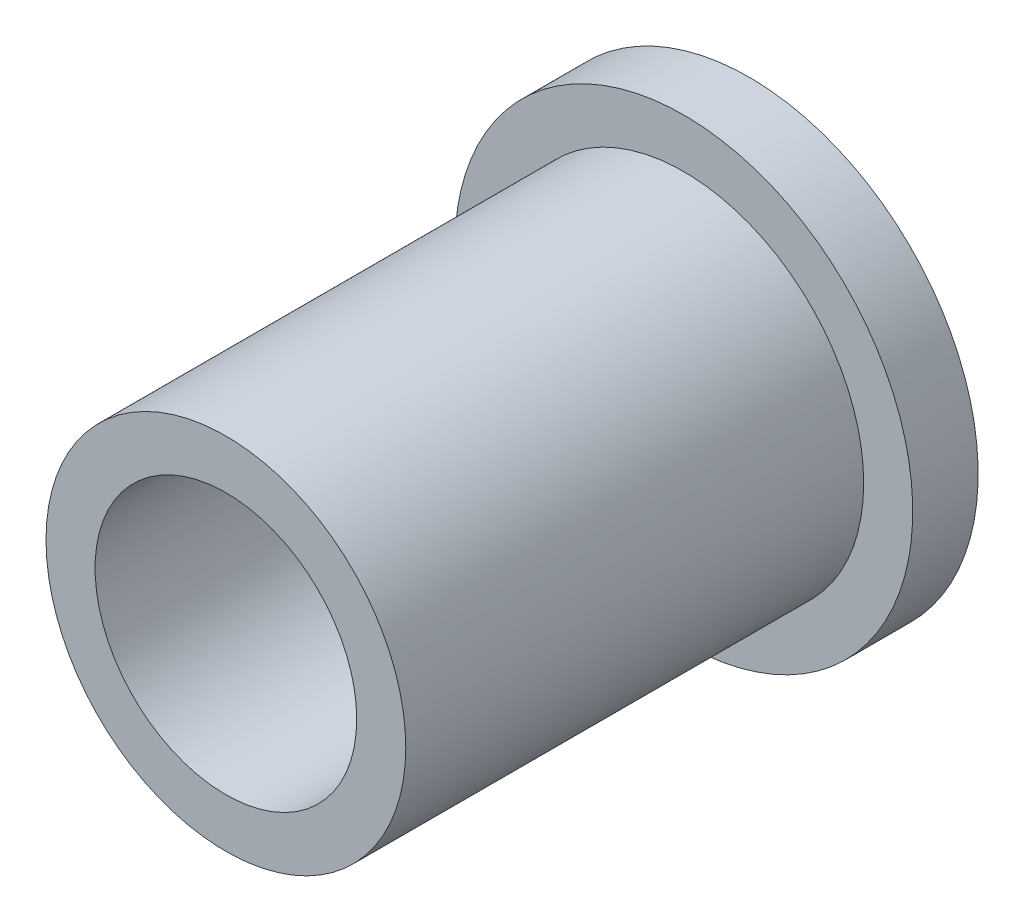
ISO-10303-21;
HEADER;
FILE_DESCRIPTION(('STEP AP214'),'2;1');
FILE_NAME('part.step','',(''),(''),'','','');
FILE_SCHEMA(('AUTOMOTIVE_DESIGN { 1 0 10303 214 1 1 1 1 }'));
ENDSEC;
DATA;
#1=APPLICATION_CONTEXT('core data for automotive mechanical design processes');
#2=APPLICATION_PROTOCOL_DEFINITION('international standard','automotive_design',2000,#1);
#3=PRODUCT_CONTEXT('',#1,'mechanical');
#4=PRODUCT('Part','Part','',(#3));
#5=PRODUCT_RELATED_PRODUCT_CATEGORY('part','',(#4));
#6=PRODUCT_DEFINITION_FORMATION('','',#4);
#7=PRODUCT_DEFINITION_CONTEXT('part definition',#1,'design');
#8=PRODUCT_DEFINITION('design','',#6,#7);
#9=PRODUCT_DEFINITION_SHAPE('','',#8);
#10=(LENGTH_UNIT() NAMED_UNIT(*) SI_UNIT(.MILLI.,.METRE.));
#11=(NAMED_UNIT(*) PLANE_ANGLE_UNIT() SI_UNIT($,.RADIAN.));
#12=(NAMED_UNIT(*) SI_UNIT($,.STERADIAN.) SOLID_ANGLE_UNIT());
#13=UNCERTAINTY_MEASURE_WITH_UNIT(LENGTH_MEASURE(1.E-05),#10,'distance_accuracy_value','');
#14=(GEOMETRIC_REPRESENTATION_CONTEXT(3) GLOBAL_UNCERTAINTY_ASSIGNED_CONTEXT((#13)) GLOBAL_UNIT_ASSIGNED_CONTEXT((#10,
#11,#12)) REPRESENTATION_CONTEXT('',''));
#15=CARTESIAN_POINT('',(0.,0.,0.));
#16=DIRECTION('',(0.,0.,1.));
#17=DIRECTION('',(1.,0.,0.));
#18=AXIS2_PLACEMENT_3D('',#15,#16,#17);
#19=CARTESIAN_POINT('',(0.,0.,8.));
#20=DIRECTION('',(0.,0.,-1.));
#21=DIRECTION('',(-1.,0.,0.));
#22=AXIS2_PLACEMENT_3D('',#19,#20,#21);
#23=CYLINDRICAL_SURFACE('',#22,2.75);
#24=CARTESIAN_POINT('',(0.,0.,8.));
#25=DIRECTION('',(0.,0.,1.));
#26=DIRECTION('',(1.,0.,0.));
#27=AXIS2_PLACEMENT_3D('',#24,#25,#26);
#28=CIRCLE('',#27,2.75);
#29=CARTESIAN_POINT('',(2.75,0.,8.));
#30=VERTEX_POINT('',#29);
#31=EDGE_CURVE('E44',#30,#30,#28,.T.);
#32=ORIENTED_EDGE('',*,*,#31,.F.);
#33=EDGE_LOOP('',(#32));
#34=FACE_BOUND('',#33,.T.);
#35=CARTESIAN_POINT('',(0.,0.,1.));
#36=DIRECTION('',(0.,0.,-1.));
#37=DIRECTION('',(-1.,0.,0.));
#38=AXIS2_PLACEMENT_3D('',#35,#36,#37);
#39=CIRCLE('',#38,2.75);
#40=CARTESIAN_POINT('',(-2.75,0.,1.));
#41=VERTEX_POINT('',#40);
#42=EDGE_CURVE('E10',#41,#41,#39,.T.);
#43=ORIENTED_EDGE('',*,*,#42,.F.);
#44=EDGE_LOOP('',(#43));
#45=FACE_BOUND('',#44,.T.);
#46=ADVANCED_FACE('F38',(#34,#45),#23,.T.);
#47=CARTESIAN_POINT('',(0.,0.,8.));
#48=DIRECTION('',(0.,0.,1.));
#49=DIRECTION('',(1.,0.,0.));
#50=AXIS2_PLACEMENT_3D('',#47,#48,#49);
#51=PLANE('',#50);
#52=ORIENTED_EDGE('',*,*,#31,.T.);
#53=EDGE_LOOP('',(#52));
#54=FACE_BOUND('',#53,.T.);
#55=CARTESIAN_POINT('',(0.,0.,8.));
#56=DIRECTION('',(0.,0.,1.));
#57=DIRECTION('',(1.,0.,0.));
#58=AXIS2_PLACEMENT_3D('',#55,#56,#57);
#59=CIRCLE('',#58,2.);
#60=CARTESIAN_POINT('',(2.,0.,8.));
#61=VERTEX_POINT('',#60);
#62=EDGE_CURVE('E48',#61,#61,#59,.T.);
#63=ORIENTED_EDGE('',*,*,#62,.F.);
#64=EDGE_LOOP('',(#63));
#65=FACE_BOUND('',#64,.T.);
#66=ADVANCED_FACE('F76',(#54,#65),#51,.T.);
#67=CARTESIAN_POINT('',(0.,0.,0.));
#68=DIRECTION('',(0.,0.,1.));
#69=DIRECTION('',(1.,0.,0.));
#70=AXIS2_PLACEMENT_3D('',#67,#68,#69);
#71=PLANE('',#70);
#72=CARTESIAN_POINT('',(0.,0.,0.));
#73=DIRECTION('',(0.,0.,1.));
#74=DIRECTION('',(1.,0.,0.));
#75=AXIS2_PLACEMENT_3D('',#72,#73,#74);
#76=CIRCLE('',#75,2.);
#77=CARTESIAN_POINT('',(2.,0.,0.));
#78=VERTEX_POINT('',#77);
#79=EDGE_CURVE('E52',#78,#78,#76,.T.);
#80=ORIENTED_EDGE('',*,*,#79,.T.);
#81=EDGE_LOOP('',(#80));
#82=FACE_BOUND('',#81,.T.);
#83=CARTESIAN_POINT('',(0.,0.,0.));
#84=DIRECTION('',(0.,0.,-1.));
#85=DIRECTION('',(-1.,0.,0.));
#86=AXIS2_PLACEMENT_3D('',#83,#84,#85);
#87=CIRCLE('',#86,3.5);
#88=CARTESIAN_POINT('',(-3.5,0.,0.));
#89=VERTEX_POINT('',#88);
#90=EDGE_CURVE('E58',#89,#89,#87,.T.);
#91=ORIENTED_EDGE('',*,*,#90,.T.);
#92=EDGE_LOOP('',(#91));
#93=FACE_BOUND('',#92,.T.);
#94=ADVANCED_FACE('F81',(#82,#93),#71,.F.);
#95=CARTESIAN_POINT('',(0.,0.,8.));
#96=DIRECTION('',(0.,0.,-1.));
#97=DIRECTION('',(-1.,0.,0.));
#98=AXIS2_PLACEMENT_3D('',#95,#96,#97);
#99=CYLINDRICAL_SURFACE('',#98,2.);
#100=ORIENTED_EDGE('',*,*,#62,.T.);
#101=EDGE_LOOP('',(#100));
#102=FACE_BOUND('',#101,.T.);
#103=ORIENTED_EDGE('',*,*,#79,.F.);
#104=EDGE_LOOP('',(#103));
#105=FACE_BOUND('',#104,.T.);
#106=ADVANCED_FACE('F73',(#102,#105),#99,.F.);
#107=CARTESIAN_POINT('',(0.,0.,1.));
#108=DIRECTION('',(0.,0.,-1.));
#109=DIRECTION('',(-1.,0.,0.));
#110=AXIS2_PLACEMENT_3D('',#107,#108,#109);
#111=CYLINDRICAL_SURFACE('',#110,3.5);
#112=CARTESIAN_POINT('',(0.,0.,1.));
#113=DIRECTION('',(0.,0.,-1.));
#114=DIRECTION('',(-1.,0.,0.));
#115=AXIS2_PLACEMENT_3D('',#112,#113,#114);
#116=CIRCLE('',#115,3.5);
#117=CARTESIAN_POINT('',(-3.5,0.,1.));
#118=VERTEX_POINT('',#117);
#119=EDGE_CURVE('E56',#118,#118,#116,.T.);
#120=ORIENTED_EDGE('',*,*,#119,.T.);
#121=EDGE_LOOP('',(#120));
#122=FACE_BOUND('',#121,.T.);
#123=ORIENTED_EDGE('',*,*,#90,.F.);
#124=EDGE_LOOP('',(#123));
#125=FACE_BOUND('',#124,.T.);
#126=ADVANCED_FACE('F64',(#122,#125),#111,.T.);
#127=CARTESIAN_POINT('',(0.,0.,1.));
#128=DIRECTION('',(0.,0.,-1.));
#129=DIRECTION('',(-1.,0.,0.));
#130=AXIS2_PLACEMENT_3D('',#127,#128,#129);
#131=PLANE('',#130);
#132=ORIENTED_EDGE('',*,*,#42,.T.);
#133=EDGE_LOOP('',(#132));
#134=FACE_BOUND('',#133,.T.);
#135=ORIENTED_EDGE('',*,*,#119,.F.);
#136=EDGE_LOOP('',(#135));
#137=FACE_BOUND('',#136,.T.);
#138=ADVANCED_FACE('F67',(#134,#137),#131,.F.);
#139=CLOSED_SHELL('',(#46,#66,#94,#106,#126,#138));
#140=MANIFOLD_SOLID_BREP('B2',#139);
#141=ADVANCED_BREP_SHAPE_REPRESENTATION('',(#18,#140),#14);
#142=SHAPE_DEFINITION_REPRESENTATION(#9,#141);
ENDSEC;
END-ISO-10303-21;
